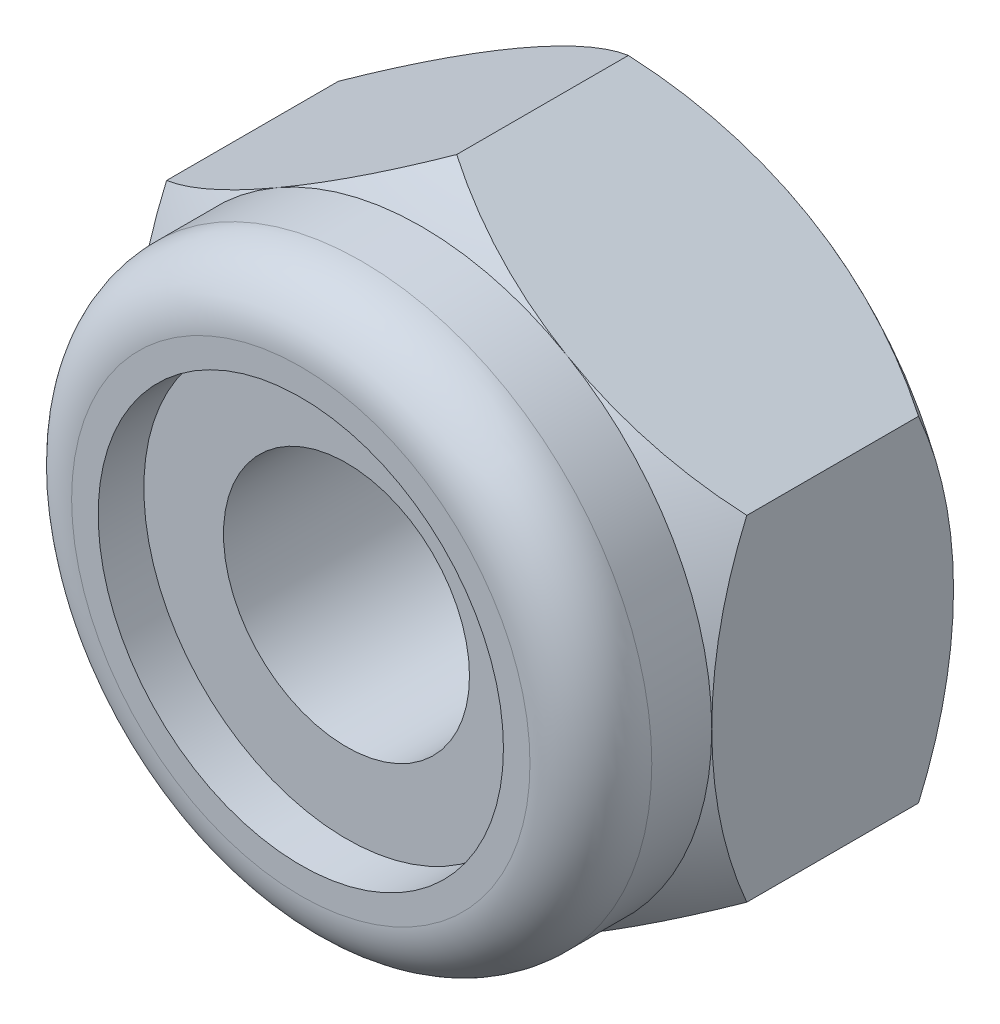
ISO-10303-21;
HEADER;
FILE_DESCRIPTION(('STEP AP214'),'2;1');
FILE_NAME('part.step','',(''),(''),'','','');
FILE_SCHEMA(('AUTOMOTIVE_DESIGN { 1 0 10303 214 1 1 1 1 }'));
ENDSEC;
DATA;
#1=APPLICATION_CONTEXT('core data for automotive mechanical design processes');
#2=APPLICATION_PROTOCOL_DEFINITION('international standard','automotive_design',2000,#1);
#3=PRODUCT_CONTEXT('',#1,'mechanical');
#4=PRODUCT('Part','Part','',(#3));
#5=PRODUCT_RELATED_PRODUCT_CATEGORY('part','',(#4));
#6=PRODUCT_DEFINITION_FORMATION('','',#4);
#7=PRODUCT_DEFINITION_CONTEXT('part definition',#1,'design');
#8=PRODUCT_DEFINITION('design','',#6,#7);
#9=PRODUCT_DEFINITION_SHAPE('','',#8);
#10=(LENGTH_UNIT() NAMED_UNIT(*) SI_UNIT(.MILLI.,.METRE.));
#11=(NAMED_UNIT(*) PLANE_ANGLE_UNIT() SI_UNIT($,.RADIAN.));
#12=(NAMED_UNIT(*) SI_UNIT($,.STERADIAN.) SOLID_ANGLE_UNIT());
#13=UNCERTAINTY_MEASURE_WITH_UNIT(LENGTH_MEASURE(1.E-05),#10,'distance_accuracy_value','');
#14=(GEOMETRIC_REPRESENTATION_CONTEXT(3) GLOBAL_UNCERTAINTY_ASSIGNED_CONTEXT((#13)) GLOBAL_UNIT_ASSIGNED_CONTEXT((#10,
#11,#12)) REPRESENTATION_CONTEXT('',''));
#15=CARTESIAN_POINT('',(0.,0.,0.));
#16=DIRECTION('',(0.,0.,1.));
#17=DIRECTION('',(1.,0.,0.));
#18=AXIS2_PLACEMENT_3D('',#15,#16,#17);
#19=CARTESIAN_POINT('',(0.,1.24344978758018E-11,4.95312499999961));
#20=DIRECTION('',(0.,0.,1.));
#21=DIRECTION('',(1.,0.,0.));
#22=AXIS2_PLACEMENT_3D('',#19,#20,#21);
#23=TOROIDAL_SURFACE('',#22,3.7625,1.);
#24=CARTESIAN_POINT('',(0.,1.24344978758018E-11,4.95312499999961));
#25=DIRECTION('',(0.,0.,-1.));
#26=DIRECTION('',(-1.,0.,0.));
#27=AXIS2_PLACEMENT_3D('',#24,#25,#26);
#28=CIRCLE('',#27,4.7625);
#29=CARTESIAN_POINT('',(-4.7625,1.24344978758018E-11,4.95312499999961));
#30=VERTEX_POINT('',#29);
#31=EDGE_CURVE('E200',#30,#30,#28,.T.);
#32=ORIENTED_EDGE('',*,*,#31,.F.);
#33=EDGE_LOOP('',(#32));
#34=FACE_BOUND('',#33,.T.);
#35=CARTESIAN_POINT('',(0.,1.24344978758018E-11,5.95312499999961));
#36=DIRECTION('',(0.,0.,-1.));
#37=DIRECTION('',(1.,0.,0.));
#38=AXIS2_PLACEMENT_3D('',#35,#36,#37);
#39=CIRCLE('',#38,3.7625);
#40=CARTESIAN_POINT('',(-3.7625,1.24349831420959E-11,5.95312499999961));
#41=VERTEX_POINT('',#40);
#42=CARTESIAN_POINT('',(3.7625,1.24344978758018E-11,5.95312499999961));
#43=VERTEX_POINT('',#42);
#44=EDGE_CURVE('E208',#41,#43,#39,.F.);
#45=ORIENTED_EDGE('',*,*,#44,.F.);
#46=CARTESIAN_POINT('',(0.,1.24344978758018E-11,5.95312499999961));
#47=DIRECTION('',(0.,0.,-1.));
#48=DIRECTION('',(-1.,0.,0.));
#49=AXIS2_PLACEMENT_3D('',#46,#47,#48);
#50=CIRCLE('',#49,3.7625);
#51=EDGE_CURVE('E206',#43,#41,#50,.F.);
#52=ORIENTED_EDGE('',*,*,#51,.F.);
#53=EDGE_LOOP('',(#45,#52));
#54=FACE_BOUND('',#53,.T.);
#55=ADVANCED_FACE('F16',(#34,#54),#23,.T.);
#56=CARTESIAN_POINT('',(0.,1.24344978758018E-11,5.95312499999961));
#57=DIRECTION('',(0.,0.,1.));
#58=DIRECTION('',(1.,0.,0.));
#59=AXIS2_PLACEMENT_3D('',#56,#57,#58);
#60=PLANE('',#59);
#61=CARTESIAN_POINT('',(0.,1.24344978758018E-11,5.95312499999961));
#62=DIRECTION('',(0.,0.,1.));
#63=DIRECTION('',(1.,0.,0.));
#64=AXIS2_PLACEMENT_3D('',#61,#62,#63);
#65=CIRCLE('',#64,3.32676299779793);
#66=CARTESIAN_POINT('',(3.32676299779793,1.24344978758018E-11,5.95312499999961));
#67=VERTEX_POINT('',#66);
#68=EDGE_CURVE('E154',#67,#67,#65,.F.);
#69=ORIENTED_EDGE('',*,*,#68,.T.);
#70=EDGE_LOOP('',(#69));
#71=FACE_BOUND('',#70,.T.);
#72=ORIENTED_EDGE('',*,*,#51,.T.);
#73=ORIENTED_EDGE('',*,*,#44,.T.);
#74=EDGE_LOOP('',(#72,#73));
#75=FACE_BOUND('',#74,.T.);
#76=ADVANCED_FACE('F216',(#71,#75),#60,.T.);
#77=CARTESIAN_POINT('',(0.,1.24344978758018E-11,5.95312499999961));
#78=DIRECTION('',(0.,0.,-1.));
#79=DIRECTION('',(-1.,0.,0.));
#80=AXIS2_PLACEMENT_3D('',#77,#78,#79);
#81=CYLINDRICAL_SURFACE('',#80,4.7625);
#82=ORIENTED_EDGE('',*,*,#31,.T.);
#83=EDGE_LOOP('',(#82));
#84=FACE_BOUND('',#83,.T.);
#85=CARTESIAN_POINT('',(0.,1.24344978758018E-11,3.96875000000001));
#86=DIRECTION('',(0.,0.,-1.));
#87=DIRECTION('',(-1.,0.,0.));
#88=AXIS2_PLACEMENT_3D('',#85,#86,#87);
#89=CIRCLE('',#88,4.7625);
#90=CARTESIAN_POINT('',(2.3812499999973,-4.12444598551874,3.96875));
#91=VERTEX_POINT('',#90);
#92=CARTESIAN_POINT('',(-2.3812499999973,-4.12444598551874,3.96875000000001));
#93=VERTEX_POINT('',#92);
#94=EDGE_CURVE('E134',#91,#93,#89,.T.);
#95=ORIENTED_EDGE('',*,*,#94,.F.);
#96=CARTESIAN_POINT('',(0.,1.24344978758018E-11,3.96875000000001));
#97=DIRECTION('',(0.,0.,-1.));
#98=DIRECTION('',(-1.,0.,0.));
#99=AXIS2_PLACEMENT_3D('',#96,#97,#98);
#100=CIRCLE('',#99,4.7625);
#101=CARTESIAN_POINT('',(4.76249999999073,3.10946746982632E-12,3.96875000000644));
#102=VERTEX_POINT('',#101);
#103=EDGE_CURVE('E185',#102,#91,#100,.T.);
#104=ORIENTED_EDGE('',*,*,#103,.F.);
#105=CARTESIAN_POINT('',(0.,1.24344978758018E-11,3.96875000000001));
#106=DIRECTION('',(0.,0.,-1.));
#107=DIRECTION('',(-1.,0.,0.));
#108=AXIS2_PLACEMENT_3D('',#105,#106,#107);
#109=CIRCLE('',#108,4.7625);
#110=CARTESIAN_POINT('',(2.38125000000269,4.12444598552807,3.96875));
#111=VERTEX_POINT('',#110);
#112=EDGE_CURVE('E188',#111,#102,#109,.T.);
#113=ORIENTED_EDGE('',*,*,#112,.F.);
#114=CARTESIAN_POINT('',(0.,1.24344978758018E-11,3.96874999999923));
#115=DIRECTION('',(0.,0.,-1.));
#116=DIRECTION('',(-1.,0.,0.));
#117=AXIS2_PLACEMENT_3D('',#114,#115,#116);
#118=CIRCLE('',#117,4.7625);
#119=CARTESIAN_POINT('',(-2.38125000000269,4.12444598552807,3.96874999999961));
#120=VERTEX_POINT('',#119);
#121=EDGE_CURVE('E192',#120,#111,#118,.T.);
#122=ORIENTED_EDGE('',*,*,#121,.F.);
#123=CARTESIAN_POINT('',(0.,1.24344978758018E-11,3.96874999999923));
#124=DIRECTION('',(0.,0.,-1.));
#125=DIRECTION('',(-1.,0.,0.));
#126=AXIS2_PLACEMENT_3D('',#123,#124,#125);
#127=CIRCLE('',#126,4.7625);
#128=CARTESIAN_POINT('',(-4.7624999999909,6.21720651084527E-12,3.96875000000634));
#129=VERTEX_POINT('',#128);
#130=EDGE_CURVE('E137',#129,#120,#127,.T.);
#131=ORIENTED_EDGE('',*,*,#130,.F.);
#132=CARTESIAN_POINT('',(0.,1.24344978758018E-11,3.96875000000001));
#133=DIRECTION('',(0.,0.,-1.));
#134=DIRECTION('',(-1.,0.,0.));
#135=AXIS2_PLACEMENT_3D('',#132,#133,#134);
#136=CIRCLE('',#135,4.7625);
#137=EDGE_CURVE('E131',#93,#129,#136,.T.);
#138=ORIENTED_EDGE('',*,*,#137,.F.);
#139=EDGE_LOOP('',(#95,#104,#113,#122,#131,#138));
#140=FACE_BOUND('',#139,.T.);
#141=ADVANCED_FACE('F133',(#84,#140),#81,.T.);
#142=CARTESIAN_POINT('',(0.,1.24344978758018E-11,5.95312499999961));
#143=DIRECTION('',(0.,0.,1.));
#144=DIRECTION('',(1.,0.,0.));
#145=AXIS2_PLACEMENT_3D('',#142,#143,#144);
#146=CYLINDRICAL_SURFACE('',#145,3.32676299779793);
#147=CARTESIAN_POINT('',(0.,1.24344978758018E-11,5.20312499999961));
#148=DIRECTION('',(0.,0.,1.));
#149=DIRECTION('',(1.,0.,0.));
#150=AXIS2_PLACEMENT_3D('',#147,#148,#149);
#151=CIRCLE('',#150,3.32676299779793);
#152=CARTESIAN_POINT('',(3.32676299779793,1.24344978758018E-11,5.20312499999961));
#153=VERTEX_POINT('',#152);
#154=EDGE_CURVE('E181',#153,#153,#151,.F.);
#155=ORIENTED_EDGE('',*,*,#154,.T.);
#156=EDGE_LOOP('',(#155));
#157=FACE_BOUND('',#156,.T.);
#158=ORIENTED_EDGE('',*,*,#68,.F.);
#159=EDGE_LOOP('',(#158));
#160=FACE_BOUND('',#159,.T.);
#161=ADVANCED_FACE('F366',(#157,#160),#146,.F.);
#162=CARTESIAN_POINT('',(0.,0.,-2.89662617308755));
#163=DIRECTION('',(1.,0.,0.));
#164=DIRECTION('',(0.,-0.514062280042827,0.857752861981334));
#165=AXIS2_PLACEMENT_3D('',#162,#163,#164);
#166=SPHERICAL_SURFACE('',#165,8.35552489362568);
#167=CARTESIAN_POINT('',(2.38125000000001,-4.12444598552341,-2.89662617308755));
#168=DIRECTION('',(0.5,-0.866025403784439,0.));
#169=DIRECTION('',(0.866025403784439,0.5,0.));
#170=AXIS2_PLACEMENT_3D('',#167,#168,#169);
#171=CIRCLE('',#170,6.86537617308755);
#172=CARTESIAN_POINT('',(3.73850256307762E-11,-5.4992613140528,3.39407499989474));
#173=VERTEX_POINT('',#172);
#174=EDGE_CURVE('E151',#91,#173,#171,.T.);
#175=ORIENTED_EDGE('',*,*,#174,.F.);
#176=ORIENTED_EDGE('',*,*,#94,.T.);
#177=CARTESIAN_POINT('',(-2.38125000000001,-4.12444598552341,-2.89662617308755));
#178=DIRECTION('',(-0.5,-0.866025403784439,0.));
#179=DIRECTION('',(0.866025403784439,-0.5,0.));
#180=AXIS2_PLACEMENT_3D('',#177,#178,#179);
#181=CIRCLE('',#180,6.86537617308755);
#182=EDGE_CURVE('E149',#173,#93,#181,.T.);
#183=ORIENTED_EDGE('',*,*,#182,.F.);
#184=EDGE_LOOP('',(#175,#176,#183));
#185=FACE_BOUND('',#184,.T.);
#186=ADVANCED_FACE('F147',(#185),#166,.T.);
#187=CARTESIAN_POINT('',(0.,0.,-2.89662617308763));
#188=DIRECTION('',(1.,0.,0.));
#189=DIRECTION('',(0.,0.0032458647859938,0.999994732167021));
#190=AXIS2_PLACEMENT_3D('',#187,#188,#189);
#191=SPHERICAL_SURFACE('',#190,8.35552489362576);
#192=CARTESIAN_POINT('',(-2.38124999999998,-4.12444598552343,-2.89662617308763));
#193=DIRECTION('',(-0.5,-0.866025403784439,0.));
#194=DIRECTION('',(0.866025403784439,-0.5,0.));
#195=AXIS2_PLACEMENT_3D('',#192,#193,#194);
#196=CIRCLE('',#195,6.86537617308764);
#197=CARTESIAN_POINT('',(-4.7625,-2.74963065700324,3.39407499991903));
#198=VERTEX_POINT('',#197);
#199=EDGE_CURVE('E156',#93,#198,#196,.T.);
#200=ORIENTED_EDGE('',*,*,#199,.F.);
#201=ORIENTED_EDGE('',*,*,#137,.T.);
#202=CARTESIAN_POINT('',(-4.7625,0.,-2.89662617308763));
#203=DIRECTION('',(1.,0.,0.));
#204=DIRECTION('',(0.,0.,-1.));
#205=AXIS2_PLACEMENT_3D('',#202,#203,#204);
#206=CIRCLE('',#205,6.86537617308764);
#207=EDGE_CURVE('E159',#198,#129,#206,.F.);
#208=ORIENTED_EDGE('',*,*,#207,.F.);
#209=EDGE_LOOP('',(#200,#201,#208));
#210=FACE_BOUND('',#209,.T.);
#211=ADVANCED_FACE('F157',(#210),#191,.T.);
#212=CARTESIAN_POINT('',(0.,0.,-2.89662617308756));
#213=DIRECTION('',(1.,0.,0.));
#214=DIRECTION('',(0.,0.517754599312731,0.855529178281205));
#215=AXIS2_PLACEMENT_3D('',#212,#213,#214);
#216=SPHERICAL_SURFACE('',#215,8.3555248936257);
#217=CARTESIAN_POINT('',(-4.76249999998179,0.,-2.89662617308756));
#218=DIRECTION('',(1.,0.,0.));
#219=DIRECTION('',(0.,0.,-1.));
#220=AXIS2_PLACEMENT_3D('',#217,#218,#219);
#221=CIRCLE('',#220,6.86537617310022);
#222=CARTESIAN_POINT('',(-4.76249999994811,2.74963065704558,3.39407499993981));
#223=VERTEX_POINT('',#222);
#224=EDGE_CURVE('E350',#129,#223,#221,.F.);
#225=ORIENTED_EDGE('',*,*,#224,.F.);
#226=ORIENTED_EDGE('',*,*,#130,.T.);
#227=CARTESIAN_POINT('',(-2.38125000000002,4.1244459855234,-2.89662617308756));
#228=DIRECTION('',(-0.5,0.866025403784439,0.));
#229=DIRECTION('',(-0.866025403784439,-0.5,0.));
#230=AXIS2_PLACEMENT_3D('',#227,#228,#229);
#231=CIRCLE('',#230,6.86537617308755);
#232=EDGE_CURVE('E345',#223,#120,#231,.T.);
#233=ORIENTED_EDGE('',*,*,#232,.F.);
#234=EDGE_LOOP('',(#225,#226,#233));
#235=FACE_BOUND('',#234,.T.);
#236=ADVANCED_FACE('F475',(#235),#216,.T.);
#237=CARTESIAN_POINT('',(0.,0.,-2.89662617308755));
#238=DIRECTION('',(1.,0.,0.));
#239=DIRECTION('',(0.,0.658959645209424,0.752178294013773));
#240=AXIS2_PLACEMENT_3D('',#237,#238,#239);
#241=SPHERICAL_SURFACE('',#240,8.35552489362569);
#242=ORIENTED_EDGE('',*,*,#121,.T.);
#243=CARTESIAN_POINT('',(2.38125000000002,4.1244459855234,-2.89662617308755));
#244=DIRECTION('',(0.5,0.866025403784439,0.));
#245=DIRECTION('',(-0.866025403784439,0.5,0.));
#246=AXIS2_PLACEMENT_3D('',#243,#244,#245);
#247=CIRCLE('',#246,6.86537617308755);
#248=CARTESIAN_POINT('',(4.83558505737225E-11,5.4992613140033,3.39407499993801));
#249=VERTEX_POINT('',#248);
#250=EDGE_CURVE('E337',#249,#111,#247,.T.);
#251=ORIENTED_EDGE('',*,*,#250,.F.);
#252=CARTESIAN_POINT('',(-2.38125000000002,4.1244459855234,-2.89662617308755));
#253=DIRECTION('',(-0.5,0.866025403784439,0.));
#254=DIRECTION('',(-0.866025403784439,-0.5,0.));
#255=AXIS2_PLACEMENT_3D('',#252,#253,#254);
#256=CIRCLE('',#255,6.86537617308755);
#257=EDGE_CURVE('E342',#120,#249,#256,.T.);
#258=ORIENTED_EDGE('',*,*,#257,.F.);
#259=EDGE_LOOP('',(#242,#251,#258));
#260=FACE_BOUND('',#259,.T.);
#261=ADVANCED_FACE('F427',(#260),#241,.T.);
#262=CARTESIAN_POINT('',(0.,0.,-2.89662617308756));
#263=DIRECTION('',(1.,0.,0.));
#264=DIRECTION('',(0.,0.517754599312728,0.855529178281206));
#265=AXIS2_PLACEMENT_3D('',#262,#263,#264);
#266=SPHERICAL_SURFACE('',#265,8.35552489362569);
#267=ORIENTED_EDGE('',*,*,#112,.T.);
#268=CARTESIAN_POINT('',(4.7625,0.,-2.89662617308756));
#269=DIRECTION('',(1.,0.,0.));
#270=DIRECTION('',(0.,0.,-1.));
#271=AXIS2_PLACEMENT_3D('',#268,#269,#270);
#272=CIRCLE('',#271,6.86537617308757);
#273=CARTESIAN_POINT('',(4.7625,2.74963065695977,3.39407499993803));
#274=VERTEX_POINT('',#273);
#275=EDGE_CURVE('E329',#274,#102,#272,.T.);
#276=ORIENTED_EDGE('',*,*,#275,.F.);
#277=CARTESIAN_POINT('',(2.38125000000001,4.12444598552341,-2.89662617308756));
#278=DIRECTION('',(0.5,0.866025403784439,0.));
#279=DIRECTION('',(-0.866025403784439,0.5,0.));
#280=AXIS2_PLACEMENT_3D('',#277,#278,#279);
#281=CIRCLE('',#280,6.86537617308756);
#282=EDGE_CURVE('E334',#111,#274,#281,.T.);
#283=ORIENTED_EDGE('',*,*,#282,.F.);
#284=EDGE_LOOP('',(#267,#276,#283));
#285=FACE_BOUND('',#284,.T.);
#286=ADVANCED_FACE('F415',(#285),#266,.T.);
#287=CARTESIAN_POINT('',(0.,0.,-2.89662617308763));
#288=DIRECTION('',(1.,0.,0.));
#289=DIRECTION('',(0.,0.00324586478599376,0.999994732167021));
#290=AXIS2_PLACEMENT_3D('',#287,#288,#289);
#291=SPHERICAL_SURFACE('',#290,8.35552489362577);
#292=ORIENTED_EDGE('',*,*,#103,.T.);
#293=CARTESIAN_POINT('',(2.38124999999998,-4.12444598552343,-2.89662617308763));
#294=DIRECTION('',(0.5,-0.866025403784439,0.));
#295=DIRECTION('',(0.866025403784439,0.5,0.));
#296=AXIS2_PLACEMENT_3D('',#293,#294,#295);
#297=CIRCLE('',#296,6.86537617308764);
#298=CARTESIAN_POINT('',(4.76249999998147,-2.74963065704567,3.39407499991452));
#299=VERTEX_POINT('',#298);
#300=EDGE_CURVE('E178',#299,#91,#297,.T.);
#301=ORIENTED_EDGE('',*,*,#300,.F.);
#302=CARTESIAN_POINT('',(4.76249999998147,0.,-2.89662617308763));
#303=DIRECTION('',(1.,0.,0.));
#304=DIRECTION('',(0.,0.,-1.));
#305=AXIS2_PLACEMENT_3D('',#302,#303,#304);
#306=CIRCLE('',#305,6.8653761731005);
#307=EDGE_CURVE('E325',#102,#299,#306,.T.);
#308=ORIENTED_EDGE('',*,*,#307,.F.);
#309=EDGE_LOOP('',(#292,#301,#308));
#310=FACE_BOUND('',#309,.T.);
#311=ADVANCED_FACE('F410',(#310),#291,.T.);
#312=CARTESIAN_POINT('',(2.01930000000006,1.24344978758018E-11,5.20312499999961));
#313=DIRECTION('',(0.,0.,-1.));
#314=DIRECTION('',(-1.,0.,0.));
#315=AXIS2_PLACEMENT_3D('',#312,#313,#314);
#316=PLANE('',#315);
#317=ORIENTED_EDGE('',*,*,#154,.F.);
#318=EDGE_LOOP('',(#317));
#319=FACE_BOUND('',#318,.T.);
#320=CARTESIAN_POINT('',(0.,1.24344978758018E-11,5.20312499999961));
#321=DIRECTION('',(0.,0.,1.));
#322=DIRECTION('',(1.,0.,0.));
#323=AXIS2_PLACEMENT_3D('',#320,#321,#322);
#324=CIRCLE('',#323,2.01930000000001);
#325=CARTESIAN_POINT('',(2.01930000000001,1.24344978758018E-11,5.20312499999961));
#326=VERTEX_POINT('',#325);
#327=EDGE_CURVE('E320',#326,#326,#324,.F.);
#328=ORIENTED_EDGE('',*,*,#327,.T.);
#329=EDGE_LOOP('',(#328));
#330=FACE_BOUND('',#329,.T.);
#331=ADVANCED_FACE('F407',(#319,#330),#316,.F.);
#332=CARTESIAN_POINT('',(2.38125,-4.12444598552342,1.984375));
#333=DIRECTION('',(0.5,-0.866025403784439,0.));
#334=DIRECTION('',(0.866025403784439,0.5,0.));
#335=AXIS2_PLACEMENT_3D('',#332,#333,#334);
#336=PLANE('',#335);
#337=CARTESIAN_POINT('',(2.3812500000054,-4.1244459855203,6.86537617308718));
#338=DIRECTION('',(0.5,-0.866025403784439,0.));
#339=DIRECTION('',(0.866025403784439,0.5,0.));
#340=AXIS2_PLACEMENT_3D('',#337,#338,#339);
#341=CIRCLE('',#340,6.86537617308008);
#342=CARTESIAN_POINT('',(2.38124999999744,-4.12444598551899,3.55054527445553E-12));
#343=VERTEX_POINT('',#342);
#344=CARTESIAN_POINT('',(3.73854593116452E-11,-5.4992613140528,0.57467500011576));
#345=VERTEX_POINT('',#344);
#346=EDGE_CURVE('E308',#343,#345,#341,.F.);
#347=ORIENTED_EDGE('',*,*,#346,.F.);
#348=CARTESIAN_POINT('',(2.38125000000536,-4.12444598552032,6.86537617308723));
#349=DIRECTION('',(0.5,-0.866025403784439,0.));
#350=DIRECTION('',(0.866025403784439,0.5,0.));
#351=AXIS2_PLACEMENT_3D('',#348,#349,#350);
#352=CIRCLE('',#351,6.86537617308013);
#353=CARTESIAN_POINT('',(4.76250000000017,-2.74963065704027,0.574675000102356));
#354=VERTEX_POINT('',#353);
#355=EDGE_CURVE('E312',#354,#343,#352,.F.);
#356=ORIENTED_EDGE('',*,*,#355,.F.);
#357=DIRECTION('',(0.,0.,-1.));
#358=VECTOR('',#357,1.);
#359=CARTESIAN_POINT('',(4.7625,-2.74963065706502,1.984375));
#360=LINE('',#359,#358);
#361=EDGE_CURVE('E324',#299,#354,#360,.T.);
#362=ORIENTED_EDGE('',*,*,#361,.F.);
#363=ORIENTED_EDGE('',*,*,#300,.T.);
#364=ORIENTED_EDGE('',*,*,#174,.T.);
#365=DIRECTION('',(0.,0.,1.));
#366=VECTOR('',#365,1.);
#367=CARTESIAN_POINT('',(7.47700512615523E-11,-5.49926131407438,1.984375));
#368=LINE('',#367,#366);
#369=EDGE_CURVE('E167',#345,#173,#368,.T.);
#370=ORIENTED_EDGE('',*,*,#369,.F.);
#371=EDGE_LOOP('',(#347,#356,#362,#363,#364,#370));
#372=FACE_BOUND('',#371,.T.);
#373=ADVANCED_FACE('F404',(#372),#336,.T.);
#374=CARTESIAN_POINT('',(-2.38125,-4.12444598552342,1.984375));
#375=DIRECTION('',(-0.5,-0.866025403784439,0.));
#376=DIRECTION('',(0.866025403784439,-0.5,0.));
#377=AXIS2_PLACEMENT_3D('',#374,#375,#376);
#378=PLANE('',#377);
#379=CARTESIAN_POINT('',(-2.38125000000538,-4.12444598552031,6.86537617308721));
#380=DIRECTION('',(-0.5,-0.866025403784439,0.));
#381=DIRECTION('',(0.866025403784439,-0.5,0.));
#382=AXIS2_PLACEMENT_3D('',#379,#380,#381);
#383=CIRCLE('',#382,6.86537617308011);
#384=CARTESIAN_POINT('',(-2.38124999999744,-4.12444598551899,3.54924423184855E-12));
#385=VERTEX_POINT('',#384);
#386=CARTESIAN_POINT('',(-4.76249999999733,-2.74963065700014,0.574675000082663));
#387=VERTEX_POINT('',#386);
#388=EDGE_CURVE('E296',#385,#387,#383,.F.);
#389=ORIENTED_EDGE('',*,*,#388,.F.);
#390=CARTESIAN_POINT('',(-2.3812500000054,-4.1244459855203,6.86537617308718));
#391=DIRECTION('',(-0.5,-0.866025403784439,0.));
#392=DIRECTION('',(0.866025403784439,-0.5,0.));
#393=AXIS2_PLACEMENT_3D('',#390,#391,#392);
#394=CIRCLE('',#393,6.86537617308008);
#395=EDGE_CURVE('E304',#345,#385,#394,.F.);
#396=ORIENTED_EDGE('',*,*,#395,.F.);
#397=ORIENTED_EDGE('',*,*,#369,.T.);
#398=ORIENTED_EDGE('',*,*,#182,.T.);
#399=ORIENTED_EDGE('',*,*,#199,.T.);
#400=DIRECTION('',(0.,0.,1.));
#401=VECTOR('',#400,1.);
#402=CARTESIAN_POINT('',(-4.7625,-2.74963065699085,1.984375));
#403=LINE('',#402,#401);
#404=EDGE_CURVE('E163',#387,#198,#403,.T.);
#405=ORIENTED_EDGE('',*,*,#404,.F.);
#406=EDGE_LOOP('',(#389,#396,#397,#398,#399,#405));
#407=FACE_BOUND('',#406,.T.);
#408=ADVANCED_FACE('F165',(#407),#378,.T.);
#409=CARTESIAN_POINT('',(-4.7625,0.,1.984375));
#410=DIRECTION('',(-1.,0.,0.));
#411=DIRECTION('',(0.,0.,1.));
#412=AXIS2_PLACEMENT_3D('',#409,#410,#411);
#413=PLANE('',#412);
#414=CARTESIAN_POINT('',(-4.7625000000002,1.24373023356119E-11,6.86537617308717));
#415=DIRECTION('',(1.,0.,0.));
#416=DIRECTION('',(0.,0.,-1.));
#417=AXIS2_PLACEMENT_3D('',#414,#415,#416);
#418=CIRCLE('',#417,6.86537617308743);
#419=CARTESIAN_POINT('',(-4.7624999999964,6.210826019676E-12,-2.87747256577653E-12));
#420=VERTEX_POINT('',#419);
#421=CARTESIAN_POINT('',(-4.7624999999573,2.74963065704027,0.574675000059021));
#422=VERTEX_POINT('',#421);
#423=EDGE_CURVE('E292',#420,#422,#418,.T.);
#424=ORIENTED_EDGE('',*,*,#423,.F.);
#425=CARTESIAN_POINT('',(-4.76249999998394,1.24086938640966E-11,6.86537617308721));
#426=DIRECTION('',(1.,0.,0.));
#427=DIRECTION('',(0.,0.,-1.));
#428=AXIS2_PLACEMENT_3D('',#425,#426,#427);
#429=CIRCLE('',#428,6.86537617309872);
#430=EDGE_CURVE('E300',#387,#420,#429,.T.);
#431=ORIENTED_EDGE('',*,*,#430,.F.);
#432=ORIENTED_EDGE('',*,*,#404,.T.);
#433=ORIENTED_EDGE('',*,*,#207,.T.);
#434=ORIENTED_EDGE('',*,*,#224,.T.);
#435=DIRECTION('',(0.,0.,1.));
#436=VECTOR('',#435,1.);
#437=CARTESIAN_POINT('',(-4.76249999991442,2.74963065706503,1.98437499999923));
#438=LINE('',#437,#436);
#439=EDGE_CURVE('E349',#422,#223,#438,.T.);
#440=ORIENTED_EDGE('',*,*,#439,.F.);
#441=EDGE_LOOP('',(#424,#431,#432,#433,#434,#440));
#442=FACE_BOUND('',#441,.T.);
#443=ADVANCED_FACE('F398',(#442),#413,.T.);
#444=CARTESIAN_POINT('',(-2.38125,4.12444598552342,1.98437499999923));
#445=DIRECTION('',(-0.5,0.866025403784439,0.));
#446=DIRECTION('',(-0.866025403784439,-0.5,0.));
#447=AXIS2_PLACEMENT_3D('',#444,#445,#446);
#448=PLANE('',#447);
#449=CARTESIAN_POINT('',(-2.38124999999462,4.12444598552652,6.86537617308721));
#450=DIRECTION('',(-0.5,0.866025403784439,0.));
#451=DIRECTION('',(-0.866025403784439,-0.5,0.));
#452=AXIS2_PLACEMENT_3D('',#449,#450,#451);
#453=CIRCLE('',#452,6.86537617309504);
#454=CARTESIAN_POINT('',(-2.38125000000283,4.12444598552831,-3.91830665136261E-12));
#455=VERTEX_POINT('',#454);
#456=CARTESIAN_POINT('',(4.83562842545915E-11,5.4992613140033,0.574675000050742));
#457=VERTEX_POINT('',#456);
#458=EDGE_CURVE('E284',#455,#457,#453,.F.);
#459=ORIENTED_EDGE('',*,*,#458,.F.);
#460=CARTESIAN_POINT('',(-2.38124999999463,4.12444598552652,6.86537617308718));
#461=DIRECTION('',(-0.5,0.866025403784439,0.));
#462=DIRECTION('',(-0.866025403784439,-0.5,0.));
#463=AXIS2_PLACEMENT_3D('',#460,#461,#462);
#464=CIRCLE('',#463,6.86537617309502);
#465=EDGE_CURVE('E288',#422,#455,#464,.F.);
#466=ORIENTED_EDGE('',*,*,#465,.F.);
#467=ORIENTED_EDGE('',*,*,#439,.T.);
#468=ORIENTED_EDGE('',*,*,#232,.T.);
#469=ORIENTED_EDGE('',*,*,#257,.T.);
#470=DIRECTION('',(0.,0.,1.));
#471=VECTOR('',#470,1.);
#472=CARTESIAN_POINT('',(9.6712134828314E-11,5.49926131397538,1.98437499999923));
#473=LINE('',#472,#471);
#474=EDGE_CURVE('E341',#457,#249,#473,.T.);
#475=ORIENTED_EDGE('',*,*,#474,.F.);
#476=EDGE_LOOP('',(#459,#466,#467,#468,#469,#475));
#477=FACE_BOUND('',#476,.T.);
#478=ADVANCED_FACE('F395',(#477),#448,.T.);
#479=CARTESIAN_POINT('',(2.38125,4.12444598552342,1.98437499999923));
#480=DIRECTION('',(0.5,0.866025403784439,0.));
#481=DIRECTION('',(-0.866025403784439,0.5,0.));
#482=AXIS2_PLACEMENT_3D('',#479,#480,#481);
#483=PLANE('',#482);
#484=CARTESIAN_POINT('',(2.38124999999461,4.12444598552653,6.86537617308722));
#485=DIRECTION('',(0.5,0.866025403784439,0.));
#486=DIRECTION('',(-0.866025403784439,0.5,0.));
#487=AXIS2_PLACEMENT_3D('',#484,#485,#486);
#488=CIRCLE('',#487,6.86537617309507);
#489=CARTESIAN_POINT('',(2.38125000000283,4.12444598552832,-3.92437818352853E-12));
#490=VERTEX_POINT('',#489);
#491=CARTESIAN_POINT('',(4.76250000000939,2.74963065695706,0.574675000062079));
#492=VERTEX_POINT('',#491);
#493=EDGE_CURVE('E42',#490,#492,#488,.F.);
#494=ORIENTED_EDGE('',*,*,#493,.F.);
#495=CARTESIAN_POINT('',(2.38124999999462,4.12444598552652,6.86537617308721));
#496=DIRECTION('',(0.5,0.866025403784439,0.));
#497=DIRECTION('',(-0.866025403784439,0.5,0.));
#498=AXIS2_PLACEMENT_3D('',#495,#496,#497);
#499=CIRCLE('',#498,6.86537617309504);
#500=EDGE_CURVE('E281',#457,#490,#499,.F.);
#501=ORIENTED_EDGE('',*,*,#500,.F.);
#502=ORIENTED_EDGE('',*,*,#474,.T.);
#503=ORIENTED_EDGE('',*,*,#250,.T.);
#504=ORIENTED_EDGE('',*,*,#282,.T.);
#505=DIRECTION('',(0.,0.,-1.));
#506=VECTOR('',#505,1.);
#507=CARTESIAN_POINT('',(4.7625,2.74963065690392,1.984375));
#508=LINE('',#507,#506);
#509=EDGE_CURVE('E333',#492,#274,#508,.F.);
#510=ORIENTED_EDGE('',*,*,#509,.F.);
#511=EDGE_LOOP('',(#494,#501,#502,#503,#504,#510));
#512=FACE_BOUND('',#511,.T.);
#513=ADVANCED_FACE('F391',(#512),#483,.T.);
#514=CARTESIAN_POINT('',(4.7625,0.,1.984375));
#515=DIRECTION('',(1.,0.,0.));
#516=DIRECTION('',(0.,0.,-1.));
#517=AXIS2_PLACEMENT_3D('',#514,#515,#516);
#518=PLANE('',#517);
#519=CARTESIAN_POINT('',(4.76250000000017,1.23976350019372E-11,6.86537617308723));
#520=DIRECTION('',(1.,0.,0.));
#521=DIRECTION('',(0.,0.,-1.));
#522=AXIS2_PLACEMENT_3D('',#519,#520,#521);
#523=CIRCLE('',#522,6.86537617308747);
#524=CARTESIAN_POINT('',(4.76250000000257,6.21704829444962E-12,1.41141438814163E-12));
#525=VERTEX_POINT('',#524);
#526=EDGE_CURVE('E316',#525,#354,#523,.F.);
#527=ORIENTED_EDGE('',*,*,#526,.F.);
#528=CARTESIAN_POINT('',(4.76250000000939,1.24345673325034E-11,6.86537617308722));
#529=DIRECTION('',(1.,0.,0.));
#530=DIRECTION('',(0.,0.,-1.));
#531=AXIS2_PLACEMENT_3D('',#528,#529,#530);
#532=CIRCLE('',#531,6.8653761730811);
#533=EDGE_CURVE('E275',#492,#525,#532,.F.);
#534=ORIENTED_EDGE('',*,*,#533,.F.);
#535=ORIENTED_EDGE('',*,*,#509,.T.);
#536=ORIENTED_EDGE('',*,*,#275,.T.);
#537=ORIENTED_EDGE('',*,*,#307,.T.);
#538=ORIENTED_EDGE('',*,*,#361,.T.);
#539=EDGE_LOOP('',(#527,#534,#535,#536,#537,#538));
#540=FACE_BOUND('',#539,.T.);
#541=ADVANCED_FACE('F387',(#540),#518,.T.);
#542=CARTESIAN_POINT('',(0.,1.24344978758018E-11,5.95312499999961));
#543=DIRECTION('',(0.,0.,1.));
#544=DIRECTION('',(1.,0.,0.));
#545=AXIS2_PLACEMENT_3D('',#542,#543,#544);
#546=CYLINDRICAL_SURFACE('',#545,2.01930000000001);
#547=CARTESIAN_POINT('',(0.,1.24344978758018E-11,0.));
#548=DIRECTION('',(0.,0.,1.));
#549=DIRECTION('',(1.,0.,0.));
#550=AXIS2_PLACEMENT_3D('',#547,#548,#549);
#551=CIRCLE('',#550,2.01930000000001);
#552=CARTESIAN_POINT('',(2.01930000000001,1.24344978758018E-11,0.));
#553=VERTEX_POINT('',#552);
#554=EDGE_CURVE('E272',#553,#553,#551,.T.);
#555=ORIENTED_EDGE('',*,*,#554,.F.);
#556=EDGE_LOOP('',(#555));
#557=FACE_BOUND('',#556,.T.);
#558=ORIENTED_EDGE('',*,*,#327,.F.);
#559=EDGE_LOOP('',(#558));
#560=FACE_BOUND('',#559,.T.);
#561=ADVANCED_FACE('F383',(#557,#560),#546,.F.);
#562=CARTESIAN_POINT('',(0.,1.23976350019372E-11,6.86537617308723));
#563=DIRECTION('',(1.,0.,0.));
#564=DIRECTION('',(0.,-0.517754599313837,-0.855529178280535));
#565=AXIS2_PLACEMENT_3D('',#562,#563,#564);
#566=SPHERICAL_SURFACE('',#565,8.35552489362571);
#567=ORIENTED_EDGE('',*,*,#355,.T.);
#568=CARTESIAN_POINT('',(0.,1.23976350019372E-11,0.));
#569=DIRECTION('',(0.,0.,-1.));
#570=DIRECTION('',(-1.,0.,0.));
#571=AXIS2_PLACEMENT_3D('',#568,#569,#570);
#572=CIRCLE('',#571,4.76250000000054);
#573=EDGE_CURVE('E268',#525,#343,#572,.T.);
#574=ORIENTED_EDGE('',*,*,#573,.F.);
#575=ORIENTED_EDGE('',*,*,#526,.T.);
#576=EDGE_LOOP('',(#567,#574,#575));
#577=FACE_BOUND('',#576,.T.);
#578=ADVANCED_FACE('F386',(#577),#566,.T.);
#579=CARTESIAN_POINT('',(0.,1.24336305140638E-11,6.86537617308718));
#580=DIRECTION('',(1.,0.,0.));
#581=DIRECTION('',(0.,-0.658959645215233,-0.752178294008684));
#582=AXIS2_PLACEMENT_3D('',#579,#580,#581);
#583=SPHERICAL_SURFACE('',#582,8.35552489362568);
#584=ORIENTED_EDGE('',*,*,#395,.T.);
#585=CARTESIAN_POINT('',(0.,1.24336305140638E-11,0.));
#586=DIRECTION('',(0.,0.,-1.));
#587=DIRECTION('',(-1.,0.,0.));
#588=AXIS2_PLACEMENT_3D('',#585,#586,#587);
#589=CIRCLE('',#588,4.76250000000056);
#590=EDGE_CURVE('E264',#343,#385,#589,.T.);
#591=ORIENTED_EDGE('',*,*,#590,.F.);
#592=ORIENTED_EDGE('',*,*,#346,.T.);
#593=EDGE_LOOP('',(#584,#591,#592));
#594=FACE_BOUND('',#593,.T.);
#595=ADVANCED_FACE('F434',(#594),#583,.T.);
#596=CARTESIAN_POINT('',(0.,1.24086938640966E-11,6.86537617308721));
#597=DIRECTION('',(1.,0.,0.));
#598=DIRECTION('',(0.,-0.517754599313839,-0.855529178280534));
#599=AXIS2_PLACEMENT_3D('',#596,#597,#598);
#600=SPHERICAL_SURFACE('',#599,8.3555248936257);
#601=CARTESIAN_POINT('',(0.,1.24086938640966E-11,0.));
#602=DIRECTION('',(0.,0.,-1.));
#603=DIRECTION('',(-1.,0.,0.));
#604=AXIS2_PLACEMENT_3D('',#601,#602,#603);
#605=CIRCLE('',#604,4.76250000000054);
#606=EDGE_CURVE('E260',#385,#420,#605,.T.);
#607=ORIENTED_EDGE('',*,*,#606,.F.);
#608=ORIENTED_EDGE('',*,*,#388,.T.);
#609=ORIENTED_EDGE('',*,*,#430,.T.);
#610=EDGE_LOOP('',(#607,#608,#609));
#611=FACE_BOUND('',#610,.T.);
#612=ADVANCED_FACE('F438',(#611),#600,.T.);
#613=CARTESIAN_POINT('',(0.,1.24345453096468E-11,6.86537617308718));
#614=DIRECTION('',(1.,0.,0.));
#615=DIRECTION('',(0.,-0.00324586478780732,-0.999994732167015));
#616=AXIS2_PLACEMENT_3D('',#613,#614,#615);
#617=SPHERICAL_SURFACE('',#616,8.35552489362568);
#618=ORIENTED_EDGE('',*,*,#465,.T.);
#619=CARTESIAN_POINT('',(0.,1.24345453096468E-11,0.));
#620=DIRECTION('',(0.,0.,-1.));
#621=DIRECTION('',(-1.,0.,0.));
#622=AXIS2_PLACEMENT_3D('',#619,#620,#621);
#623=CIRCLE('',#622,4.76250000000056);
#624=EDGE_CURVE('E256',#420,#455,#623,.T.);
#625=ORIENTED_EDGE('',*,*,#624,.F.);
#626=ORIENTED_EDGE('',*,*,#423,.T.);
#627=EDGE_LOOP('',(#618,#625,#626));
#628=FACE_BOUND('',#627,.T.);
#629=ADVANCED_FACE('F442',(#628),#617,.T.);
#630=CARTESIAN_POINT('',(0.,1.24453398975266E-11,6.86537617308721));
#631=DIRECTION('',(1.,0.,0.));
#632=DIRECTION('',(0.,0.514062280041625,-0.857752861982054));
#633=AXIS2_PLACEMENT_3D('',#630,#631,#632);
#634=SPHERICAL_SURFACE('',#633,8.3555248936257);
#635=ORIENTED_EDGE('',*,*,#500,.T.);
#636=CARTESIAN_POINT('',(0.,1.24453398975266E-11,0.));
#637=DIRECTION('',(0.,0.,-1.));
#638=DIRECTION('',(-1.,0.,0.));
#639=AXIS2_PLACEMENT_3D('',#636,#637,#638);
#640=CIRCLE('',#639,4.76250000000055);
#641=EDGE_CURVE('E29',#455,#490,#640,.T.);
#642=ORIENTED_EDGE('',*,*,#641,.F.);
#643=ORIENTED_EDGE('',*,*,#458,.T.);
#644=EDGE_LOOP('',(#635,#642,#643));
#645=FACE_BOUND('',#644,.T.);
#646=ADVANCED_FACE('F379',(#645),#634,.T.);
#647=CARTESIAN_POINT('',(0.,1.24345673325034E-11,6.86537617308722));
#648=DIRECTION('',(1.,0.,0.));
#649=DIRECTION('',(0.,-0.00324586478780731,-0.999994732167015));
#650=AXIS2_PLACEMENT_3D('',#647,#648,#649);
#651=SPHERICAL_SURFACE('',#650,8.35552489362573);
#652=ORIENTED_EDGE('',*,*,#533,.T.);
#653=CARTESIAN_POINT('',(0.,1.24345673325034E-11,0.));
#654=DIRECTION('',(0.,0.,-1.));
#655=DIRECTION('',(-1.,0.,0.));
#656=AXIS2_PLACEMENT_3D('',#653,#654,#655);
#657=CIRCLE('',#656,4.76250000000058);
#658=EDGE_CURVE('E11',#490,#525,#657,.T.);
#659=ORIENTED_EDGE('',*,*,#658,.F.);
#660=ORIENTED_EDGE('',*,*,#493,.T.);
#661=EDGE_LOOP('',(#652,#659,#660));
#662=FACE_BOUND('',#661,.T.);
#663=ADVANCED_FACE('F18',(#662),#651,.T.);
#664=CARTESIAN_POINT('',(0.,0.,0.));
#665=DIRECTION('',(0.,0.,-1.));
#666=DIRECTION('',(-1.,0.,0.));
#667=AXIS2_PLACEMENT_3D('',#664,#665,#666);
#668=PLANE('',#667);
#669=ORIENTED_EDGE('',*,*,#641,.T.);
#670=ORIENTED_EDGE('',*,*,#658,.T.);
#671=ORIENTED_EDGE('',*,*,#573,.T.);
#672=ORIENTED_EDGE('',*,*,#590,.T.);
#673=ORIENTED_EDGE('',*,*,#606,.T.);
#674=ORIENTED_EDGE('',*,*,#624,.T.);
#675=EDGE_LOOP('',(#669,#670,#671,#672,#673,#674));
#676=FACE_BOUND('',#675,.T.);
#677=ORIENTED_EDGE('',*,*,#554,.T.);
#678=EDGE_LOOP('',(#677));
#679=FACE_BOUND('',#678,.T.);
#680=ADVANCED_FACE('F372',(#676,#679),#668,.T.);
#681=CLOSED_SHELL('',(#55,#76,#141,#161,#186,#211,#236,#261,#286,#311,#331,#373,#408,#443,#478,
#513,#541,#561,#578,#595,#612,#629,#646,#663,#680));
#682=MANIFOLD_SOLID_BREP('B1',#681);
#683=ADVANCED_BREP_SHAPE_REPRESENTATION('',(#18,#682),#14);
#684=SHAPE_DEFINITION_REPRESENTATION(#9,#683);
ENDSEC;
END-ISO-10303-21;
